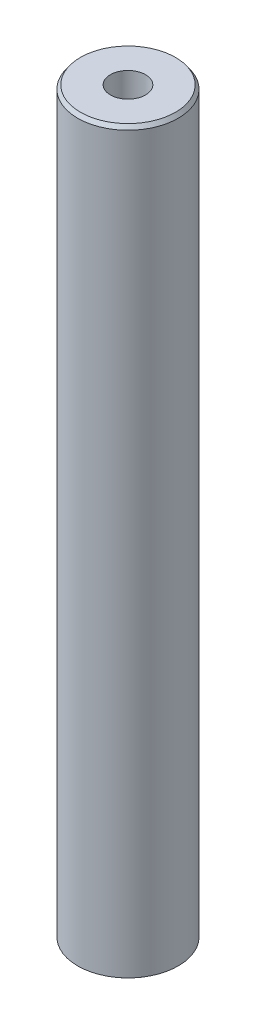
ISO-10303-21;
HEADER;
FILE_DESCRIPTION(('STEP AP214'),'2;1');
FILE_NAME('part.step','',(''),(''),'','','');
FILE_SCHEMA(('AUTOMOTIVE_DESIGN { 1 0 10303 214 1 1 1 1 }'));
ENDSEC;
DATA;
#1=APPLICATION_CONTEXT('core data for automotive mechanical design processes');
#2=APPLICATION_PROTOCOL_DEFINITION('international standard','automotive_design',2000,#1);
#3=PRODUCT_CONTEXT('',#1,'mechanical');
#4=PRODUCT('Part','Part','',(#3));
#5=PRODUCT_RELATED_PRODUCT_CATEGORY('part','',(#4));
#6=PRODUCT_DEFINITION_FORMATION('','',#4);
#7=PRODUCT_DEFINITION_CONTEXT('part definition',#1,'design');
#8=PRODUCT_DEFINITION('design','',#6,#7);
#9=PRODUCT_DEFINITION_SHAPE('','',#8);
#10=(LENGTH_UNIT() NAMED_UNIT(*) SI_UNIT(.MILLI.,.METRE.));
#11=(NAMED_UNIT(*) PLANE_ANGLE_UNIT() SI_UNIT($,.RADIAN.));
#12=(NAMED_UNIT(*) SI_UNIT($,.STERADIAN.) SOLID_ANGLE_UNIT());
#13=UNCERTAINTY_MEASURE_WITH_UNIT(LENGTH_MEASURE(1.E-05),#10,'distance_accuracy_value','');
#14=(GEOMETRIC_REPRESENTATION_CONTEXT(3) GLOBAL_UNCERTAINTY_ASSIGNED_CONTEXT((#13)) GLOBAL_UNIT_ASSIGNED_CONTEXT((#10,
#11,#12)) REPRESENTATION_CONTEXT('',''));
#15=CARTESIAN_POINT('',(0.,0.,0.));
#16=DIRECTION('',(0.,0.,1.));
#17=DIRECTION('',(1.,0.,0.));
#18=AXIS2_PLACEMENT_3D('',#15,#16,#17);
#19=CARTESIAN_POINT('',(0.,589.248914063628,0.));
#20=DIRECTION('',(0.,-1.,0.));
#21=DIRECTION('',(0.,0.,-1.));
#22=AXIS2_PLACEMENT_3D('',#19,#20,#21);
#23=CYLINDRICAL_SURFACE('',#22,40.);
#24=CARTESIAN_POINT('',(0.,586.209906986554,0.));
#25=DIRECTION('',(0.,1.,0.));
#26=DIRECTION('',(0.,0.,1.));
#27=AXIS2_PLACEMENT_3D('',#24,#25,#26);
#28=CIRCLE('',#27,40.);
#29=CARTESIAN_POINT('',(0.,586.209906986554,40.));
#30=VERTEX_POINT('',#29);
#31=EDGE_CURVE('E50',#30,#30,#28,.F.);
#32=ORIENTED_EDGE('',*,*,#31,.T.);
#33=EDGE_LOOP('',(#32));
#34=FACE_BOUND('',#33,.T.);
#35=CARTESIAN_POINT('',(0.,2.18135269578579,0.));
#36=DIRECTION('',(0.,1.,0.));
#37=DIRECTION('',(0.,0.,1.));
#38=AXIS2_PLACEMENT_3D('',#35,#36,#37);
#39=CIRCLE('',#38,40.);
#40=CARTESIAN_POINT('',(0.,2.18135269578579,40.));
#41=VERTEX_POINT('',#40);
#42=EDGE_CURVE('E51',#41,#41,#39,.T.);
#43=ORIENTED_EDGE('',*,*,#42,.T.);
#44=EDGE_LOOP('',(#43));
#45=FACE_BOUND('',#44,.T.);
#46=ADVANCED_FACE('F39',(#34,#45),#23,.T.);
#47=CARTESIAN_POINT('',(0.,589.248914063628,0.));
#48=DIRECTION('',(0.,1.,0.));
#49=DIRECTION('',(0.,0.,1.));
#50=AXIS2_PLACEMENT_3D('',#47,#48,#49);
#51=PLANE('',#50);
#52=CARTESIAN_POINT('',(0.,589.248914063628,0.));
#53=DIRECTION('',(0.,1.,0.));
#54=DIRECTION('',(0.,0.,1.));
#55=AXIS2_PLACEMENT_3D('',#52,#53,#54);
#56=CIRCLE('',#55,37.8186473042141);
#57=CARTESIAN_POINT('',(0.,589.248914063628,37.8186473042141));
#58=VERTEX_POINT('',#57);
#59=EDGE_CURVE('E54',#58,#58,#56,.T.);
#60=ORIENTED_EDGE('',*,*,#59,.T.);
#61=EDGE_LOOP('',(#60));
#62=FACE_BOUND('',#61,.T.);
#63=CARTESIAN_POINT('',(0.,589.248914063628,0.));
#64=DIRECTION('',(0.,1.,0.));
#65=DIRECTION('',(0.,0.,1.));
#66=AXIS2_PLACEMENT_3D('',#63,#64,#65);
#67=CIRCLE('',#66,13.9981733320777);
#68=CARTESIAN_POINT('',(0.,589.248914063628,13.9981733320777));
#69=VERTEX_POINT('',#68);
#70=EDGE_CURVE('E58',#69,#69,#67,.T.);
#71=ORIENTED_EDGE('',*,*,#70,.F.);
#72=EDGE_LOOP('',(#71));
#73=FACE_BOUND('',#72,.T.);
#74=ADVANCED_FACE('F69',(#62,#73),#51,.T.);
#75=CARTESIAN_POINT('',(0.,0.,0.));
#76=DIRECTION('',(0.,1.,0.));
#77=DIRECTION('',(0.,0.,1.));
#78=AXIS2_PLACEMENT_3D('',#75,#76,#77);
#79=PLANE('',#78);
#80=CARTESIAN_POINT('',(0.,0.,0.));
#81=DIRECTION('',(0.,1.,0.));
#82=DIRECTION('',(0.,0.,1.));
#83=AXIS2_PLACEMENT_3D('',#80,#81,#82);
#84=CIRCLE('',#83,36.9609929229264);
#85=CARTESIAN_POINT('',(0.,0.,36.9609929229264));
#86=VERTEX_POINT('',#85);
#87=EDGE_CURVE('E10',#86,#86,#84,.F.);
#88=ORIENTED_EDGE('',*,*,#87,.T.);
#89=EDGE_LOOP('',(#88));
#90=FACE_BOUND('',#89,.T.);
#91=CARTESIAN_POINT('',(0.,0.,0.));
#92=DIRECTION('',(0.,1.,0.));
#93=DIRECTION('',(0.,0.,1.));
#94=AXIS2_PLACEMENT_3D('',#91,#92,#93);
#95=CIRCLE('',#94,13.9981733320777);
#96=CARTESIAN_POINT('',(0.,0.,13.9981733320777));
#97=VERTEX_POINT('',#96);
#98=EDGE_CURVE('E63',#97,#97,#95,.T.);
#99=ORIENTED_EDGE('',*,*,#98,.T.);
#100=EDGE_LOOP('',(#99));
#101=FACE_BOUND('',#100,.T.);
#102=ADVANCED_FACE('F75',(#90,#101),#79,.F.);
#103=CARTESIAN_POINT('',(0.,589.248914063628,0.));
#104=DIRECTION('',(0.,-1.,0.));
#105=DIRECTION('',(0.,0.,-1.));
#106=AXIS2_PLACEMENT_3D('',#103,#104,#105);
#107=CYLINDRICAL_SURFACE('',#106,13.9981733320777);
#108=ORIENTED_EDGE('',*,*,#70,.T.);
#109=EDGE_LOOP('',(#108));
#110=FACE_BOUND('',#109,.T.);
#111=ORIENTED_EDGE('',*,*,#98,.F.);
#112=EDGE_LOOP('',(#111));
#113=FACE_BOUND('',#112,.T.);
#114=ADVANCED_FACE('F70',(#110,#113),#107,.F.);
#115=CARTESIAN_POINT('',(0.,589.248914063628,0.));
#116=DIRECTION('',(0.,-1.,0.));
#117=DIRECTION('',(0.,0.,-1.));
#118=AXIS2_PLACEMENT_3D('',#115,#116,#117);
#119=CONICAL_SURFACE('',#118,37.8186473042141,0.622562530882914);
#120=ORIENTED_EDGE('',*,*,#31,.F.);
#121=EDGE_LOOP('',(#120));
#122=FACE_BOUND('',#121,.T.);
#123=ORIENTED_EDGE('',*,*,#59,.F.);
#124=EDGE_LOOP('',(#123));
#125=FACE_BOUND('',#124,.T.);
#126=ADVANCED_FACE('F81',(#122,#125),#119,.T.);
#127=CARTESIAN_POINT('',(0.,2.18135269578579,0.));
#128=DIRECTION('',(0.,1.,0.));
#129=DIRECTION('',(0.,0.,1.));
#130=AXIS2_PLACEMENT_3D('',#127,#128,#129);
#131=CONICAL_SURFACE('',#130,40.,0.948233795911983);
#132=ORIENTED_EDGE('',*,*,#87,.F.);
#133=EDGE_LOOP('',(#132));
#134=FACE_BOUND('',#133,.T.);
#135=ORIENTED_EDGE('',*,*,#42,.F.);
#136=EDGE_LOOP('',(#135));
#137=FACE_BOUND('',#136,.T.);
#138=ADVANCED_FACE('F45',(#134,#137),#131,.T.);
#139=CLOSED_SHELL('',(#46,#74,#102,#114,#126,#138));
#140=MANIFOLD_SOLID_BREP('B2',#139);
#141=ADVANCED_BREP_SHAPE_REPRESENTATION('',(#18,#140),#14);
#142=SHAPE_DEFINITION_REPRESENTATION(#9,#141);
ENDSEC;
END-ISO-10303-21;
